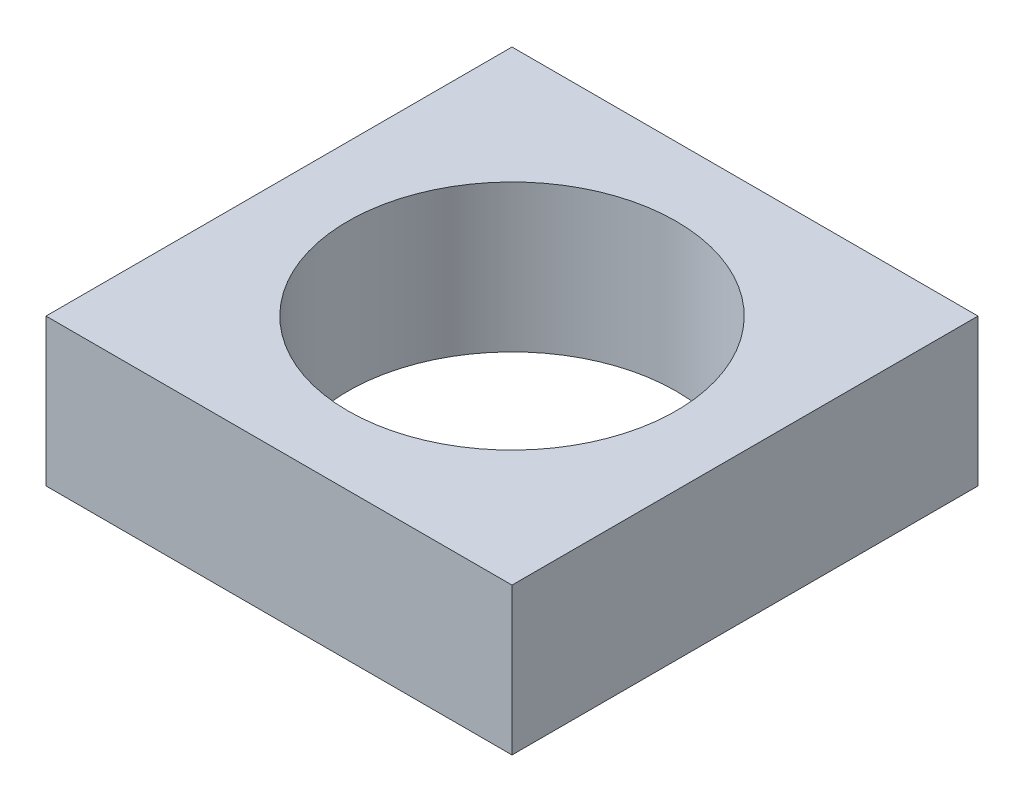
ISO-10303-21;
HEADER;
FILE_DESCRIPTION(('STEP AP214'),'2;1');
FILE_NAME('part.step','',(''),(''),'','','');
FILE_SCHEMA(('AUTOMOTIVE_DESIGN { 1 0 10303 214 1 1 1 1 }'));
ENDSEC;
DATA;
#1=APPLICATION_CONTEXT('core data for automotive mechanical design processes');
#2=APPLICATION_PROTOCOL_DEFINITION('international standard','automotive_design',2000,#1);
#3=PRODUCT_CONTEXT('',#1,'mechanical');
#4=PRODUCT('Part','Part','',(#3));
#5=PRODUCT_RELATED_PRODUCT_CATEGORY('part','',(#4));
#6=PRODUCT_DEFINITION_FORMATION('','',#4);
#7=PRODUCT_DEFINITION_CONTEXT('part definition',#1,'design');
#8=PRODUCT_DEFINITION('design','',#6,#7);
#9=PRODUCT_DEFINITION_SHAPE('','',#8);
#10=(LENGTH_UNIT() NAMED_UNIT(*) SI_UNIT(.MILLI.,.METRE.));
#11=(NAMED_UNIT(*) PLANE_ANGLE_UNIT() SI_UNIT($,.RADIAN.));
#12=(NAMED_UNIT(*) SI_UNIT($,.STERADIAN.) SOLID_ANGLE_UNIT());
#13=UNCERTAINTY_MEASURE_WITH_UNIT(LENGTH_MEASURE(1.E-05),#10,'distance_accuracy_value','');
#14=(GEOMETRIC_REPRESENTATION_CONTEXT(3) GLOBAL_UNCERTAINTY_ASSIGNED_CONTEXT((#13)) GLOBAL_UNIT_ASSIGNED_CONTEXT((#10,
#11,#12)) REPRESENTATION_CONTEXT('',''));
#15=CARTESIAN_POINT('',(0.,0.,0.));
#16=DIRECTION('',(0.,0.,1.));
#17=DIRECTION('',(1.,0.,0.));
#18=AXIS2_PLACEMENT_3D('',#15,#16,#17);
#19=CARTESIAN_POINT('',(0.,3.048,0.));
#20=DIRECTION('',(0.,-1.,0.));
#21=DIRECTION('',(0.,0.,-1.));
#22=AXIS2_PLACEMENT_3D('',#19,#20,#21);
#23=PLANE('',#22);
#24=DIRECTION('',(0.,0.,-1.));
#25=VECTOR('',#24,1.);
#26=CARTESIAN_POINT('',(4.826,3.048,4.826));
#27=LINE('',#26,#25);
#28=CARTESIAN_POINT('',(4.826,3.048,4.826));
#29=VERTEX_POINT('',#28);
#30=CARTESIAN_POINT('',(4.826,3.048,-4.826));
#31=VERTEX_POINT('',#30);
#32=EDGE_CURVE('E87',#29,#31,#27,.T.);
#33=ORIENTED_EDGE('',*,*,#32,.T.);
#34=DIRECTION('',(-1.,0.,0.));
#35=VECTOR('',#34,1.);
#36=CARTESIAN_POINT('',(-4.826,3.048,-4.826));
#37=LINE('',#36,#35);
#38=CARTESIAN_POINT('',(-4.826,3.048,-4.826));
#39=VERTEX_POINT('',#38);
#40=EDGE_CURVE('E82',#31,#39,#37,.T.);
#41=ORIENTED_EDGE('',*,*,#40,.T.);
#42=DIRECTION('',(0.,0.,1.));
#43=VECTOR('',#42,1.);
#44=CARTESIAN_POINT('',(-4.826,3.048,4.826));
#45=LINE('',#44,#43);
#46=CARTESIAN_POINT('',(-4.826,3.048,4.826));
#47=VERTEX_POINT('',#46);
#48=EDGE_CURVE('E85',#39,#47,#45,.T.);
#49=ORIENTED_EDGE('',*,*,#48,.T.);
#50=DIRECTION('',(1.,0.,0.));
#51=VECTOR('',#50,1.);
#52=CARTESIAN_POINT('',(-4.826,3.048,4.826));
#53=LINE('',#52,#51);
#54=EDGE_CURVE('E52',#47,#29,#53,.T.);
#55=ORIENTED_EDGE('',*,*,#54,.T.);
#56=EDGE_LOOP('',(#33,#41,#49,#55));
#57=FACE_BOUND('',#56,.T.);
#58=CARTESIAN_POINT('',(0.,3.048,0.));
#59=DIRECTION('',(0.,1.,0.));
#60=DIRECTION('',(0.,0.,1.));
#61=AXIS2_PLACEMENT_3D('',#58,#59,#60);
#62=CIRCLE('',#61,3.40106);
#63=CARTESIAN_POINT('',(0.,3.048,3.40106));
#64=VERTEX_POINT('',#63);
#65=EDGE_CURVE('E102',#64,#64,#62,.T.);
#66=ORIENTED_EDGE('',*,*,#65,.F.);
#67=EDGE_LOOP('',(#66));
#68=FACE_BOUND('',#67,.T.);
#69=ADVANCED_FACE('F35',(#57,#68),#23,.F.);
#70=CARTESIAN_POINT('',(0.,0.,0.));
#71=DIRECTION('',(0.,-1.,0.));
#72=DIRECTION('',(0.,0.,-1.));
#73=AXIS2_PLACEMENT_3D('',#70,#71,#72);
#74=PLANE('',#73);
#75=DIRECTION('',(0.,0.,-1.));
#76=VECTOR('',#75,1.);
#77=CARTESIAN_POINT('',(4.826,0.,4.826));
#78=LINE('',#77,#76);
#79=CARTESIAN_POINT('',(4.826,0.,4.826));
#80=VERTEX_POINT('',#79);
#81=CARTESIAN_POINT('',(4.826,0.,-4.826));
#82=VERTEX_POINT('',#81);
#83=EDGE_CURVE('E99',#80,#82,#78,.T.);
#84=ORIENTED_EDGE('',*,*,#83,.F.);
#85=DIRECTION('',(1.,0.,0.));
#86=VECTOR('',#85,1.);
#87=CARTESIAN_POINT('',(-4.826,0.,4.826));
#88=LINE('',#87,#86);
#89=CARTESIAN_POINT('',(-4.826,0.,4.826));
#90=VERTEX_POINT('',#89);
#91=EDGE_CURVE('E75',#90,#80,#88,.T.);
#92=ORIENTED_EDGE('',*,*,#91,.F.);
#93=DIRECTION('',(0.,0.,1.));
#94=VECTOR('',#93,1.);
#95=CARTESIAN_POINT('',(-4.826,0.,4.826));
#96=LINE('',#95,#94);
#97=CARTESIAN_POINT('',(-4.826,0.,-4.826));
#98=VERTEX_POINT('',#97);
#99=EDGE_CURVE('E69',#98,#90,#96,.T.);
#100=ORIENTED_EDGE('',*,*,#99,.F.);
#101=DIRECTION('',(-1.,0.,0.));
#102=VECTOR('',#101,1.);
#103=CARTESIAN_POINT('',(-4.826,0.,-4.826));
#104=LINE('',#103,#102);
#105=EDGE_CURVE('E91',#82,#98,#104,.T.);
#106=ORIENTED_EDGE('',*,*,#105,.F.);
#107=EDGE_LOOP('',(#84,#92,#100,#106));
#108=FACE_BOUND('',#107,.T.);
#109=CARTESIAN_POINT('',(0.,0.,0.));
#110=DIRECTION('',(0.,1.,0.));
#111=DIRECTION('',(0.,0.,1.));
#112=AXIS2_PLACEMENT_3D('',#109,#110,#111);
#113=CIRCLE('',#112,3.40106);
#114=CARTESIAN_POINT('',(0.,0.,3.40106));
#115=VERTEX_POINT('',#114);
#116=EDGE_CURVE('E114',#115,#115,#113,.T.);
#117=ORIENTED_EDGE('',*,*,#116,.T.);
#118=EDGE_LOOP('',(#117));
#119=FACE_BOUND('',#118,.T.);
#120=ADVANCED_FACE('F110',(#108,#119),#74,.T.);
#121=CARTESIAN_POINT('',(4.826,3.048,4.826));
#122=DIRECTION('',(-1.,0.,0.));
#123=DIRECTION('',(0.,0.,1.));
#124=AXIS2_PLACEMENT_3D('',#121,#122,#123);
#125=PLANE('',#124);
#126=ORIENTED_EDGE('',*,*,#83,.T.);
#127=DIRECTION('',(0.,-1.,0.));
#128=VECTOR('',#127,1.);
#129=CARTESIAN_POINT('',(4.826,3.048,-4.826));
#130=LINE('',#129,#128);
#131=EDGE_CURVE('E11',#31,#82,#130,.T.);
#132=ORIENTED_EDGE('',*,*,#131,.F.);
#133=ORIENTED_EDGE('',*,*,#32,.F.);
#134=DIRECTION('',(0.,-1.,0.));
#135=VECTOR('',#134,1.);
#136=CARTESIAN_POINT('',(4.826,3.048,4.826));
#137=LINE('',#136,#135);
#138=EDGE_CURVE('E95',#29,#80,#137,.T.);
#139=ORIENTED_EDGE('',*,*,#138,.T.);
#140=EDGE_LOOP('',(#126,#132,#133,#139));
#141=FACE_BOUND('',#140,.T.);
#142=ADVANCED_FACE('F37',(#141),#125,.F.);
#143=CARTESIAN_POINT('',(-4.826,3.048,-4.826));
#144=DIRECTION('',(0.,0.,1.));
#145=DIRECTION('',(1.,0.,0.));
#146=AXIS2_PLACEMENT_3D('',#143,#144,#145);
#147=PLANE('',#146);
#148=ORIENTED_EDGE('',*,*,#105,.T.);
#149=DIRECTION('',(0.,-1.,0.));
#150=VECTOR('',#149,1.);
#151=CARTESIAN_POINT('',(-4.826,3.048,-4.826));
#152=LINE('',#151,#150);
#153=EDGE_CURVE('E44',#39,#98,#152,.T.);
#154=ORIENTED_EDGE('',*,*,#153,.F.);
#155=ORIENTED_EDGE('',*,*,#40,.F.);
#156=ORIENTED_EDGE('',*,*,#131,.T.);
#157=EDGE_LOOP('',(#148,#154,#155,#156));
#158=FACE_BOUND('',#157,.T.);
#159=ADVANCED_FACE('F90',(#158),#147,.F.);
#160=CARTESIAN_POINT('',(-4.826,3.048,4.826));
#161=DIRECTION('',(1.,0.,0.));
#162=DIRECTION('',(0.,0.,-1.));
#163=AXIS2_PLACEMENT_3D('',#160,#161,#162);
#164=PLANE('',#163);
#165=ORIENTED_EDGE('',*,*,#99,.T.);
#166=DIRECTION('',(0.,-1.,0.));
#167=VECTOR('',#166,1.);
#168=CARTESIAN_POINT('',(-4.826,3.048,4.826));
#169=LINE('',#168,#167);
#170=EDGE_CURVE('E92',#47,#90,#169,.T.);
#171=ORIENTED_EDGE('',*,*,#170,.F.);
#172=ORIENTED_EDGE('',*,*,#48,.F.);
#173=ORIENTED_EDGE('',*,*,#153,.T.);
#174=EDGE_LOOP('',(#165,#171,#172,#173));
#175=FACE_BOUND('',#174,.T.);
#176=ADVANCED_FACE('F93',(#175),#164,.F.);
#177=CARTESIAN_POINT('',(-4.826,3.048,4.826));
#178=DIRECTION('',(0.,0.,-1.));
#179=DIRECTION('',(-1.,0.,0.));
#180=AXIS2_PLACEMENT_3D('',#177,#178,#179);
#181=PLANE('',#180);
#182=ORIENTED_EDGE('',*,*,#91,.T.);
#183=ORIENTED_EDGE('',*,*,#138,.F.);
#184=ORIENTED_EDGE('',*,*,#54,.F.);
#185=ORIENTED_EDGE('',*,*,#170,.T.);
#186=EDGE_LOOP('',(#182,#183,#184,#185));
#187=FACE_BOUND('',#186,.T.);
#188=ADVANCED_FACE('F107',(#187),#181,.F.);
#189=CARTESIAN_POINT('',(0.,3.048,0.));
#190=DIRECTION('',(0.,-1.,0.));
#191=DIRECTION('',(0.,0.,-1.));
#192=AXIS2_PLACEMENT_3D('',#189,#190,#191);
#193=CYLINDRICAL_SURFACE('',#192,3.40106);
#194=ORIENTED_EDGE('',*,*,#65,.T.);
#195=EDGE_LOOP('',(#194));
#196=FACE_BOUND('',#195,.T.);
#197=ORIENTED_EDGE('',*,*,#116,.F.);
#198=EDGE_LOOP('',(#197));
#199=FACE_BOUND('',#198,.T.);
#200=ADVANCED_FACE('F120',(#196,#199),#193,.F.);
#201=CLOSED_SHELL('',(#69,#120,#142,#159,#176,#188,#200));
#202=MANIFOLD_SOLID_BREP('B2',#201);
#203=ADVANCED_BREP_SHAPE_REPRESENTATION('',(#18,#202),#14);
#204=SHAPE_DEFINITION_REPRESENTATION(#9,#203);
ENDSEC;
END-ISO-10303-21;
